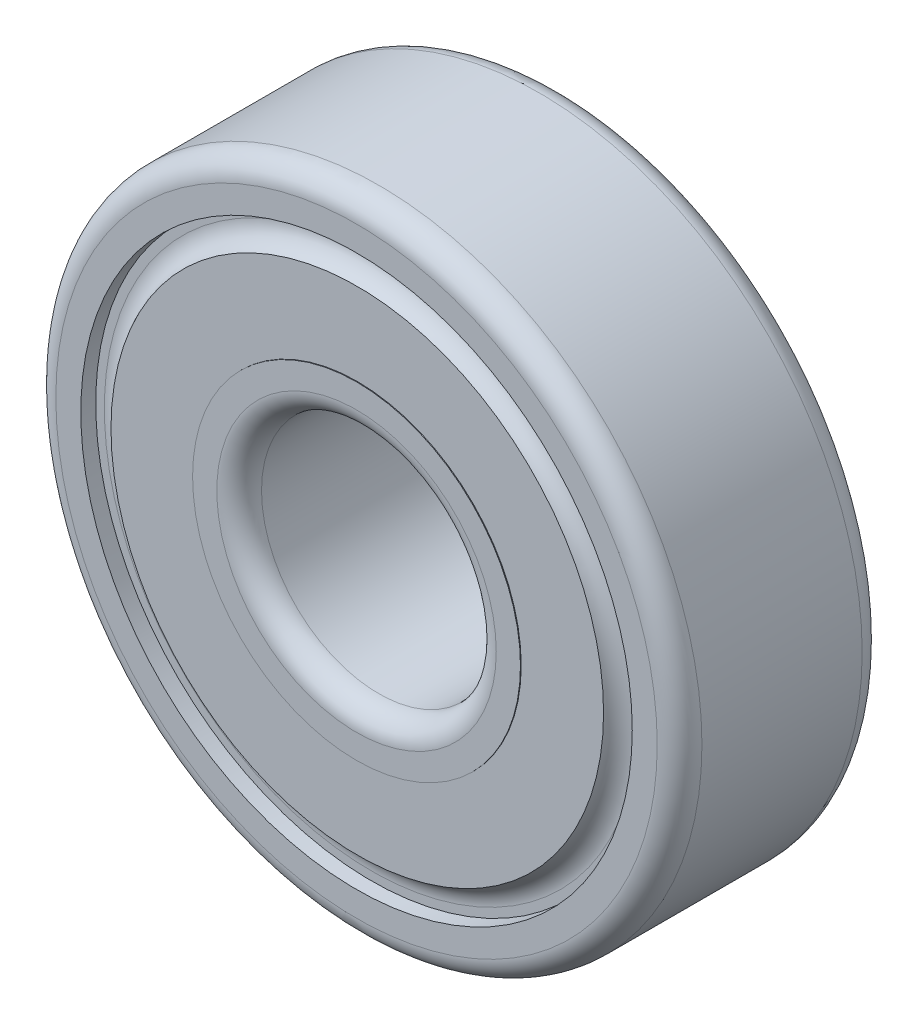
ISO-10303-21;
HEADER;
FILE_DESCRIPTION(('STEP AP214'),'2;1');
FILE_NAME('part.step','',(''),(''),'','','');
FILE_SCHEMA(('AUTOMOTIVE_DESIGN { 1 0 10303 214 1 1 1 1 }'));
ENDSEC;
DATA;
#1=APPLICATION_CONTEXT('core data for automotive mechanical design processes');
#2=APPLICATION_PROTOCOL_DEFINITION('international standard','automotive_design',2000,#1);
#3=PRODUCT_CONTEXT('',#1,'mechanical');
#4=PRODUCT('Part','Part','',(#3));
#5=PRODUCT_RELATED_PRODUCT_CATEGORY('part','',(#4));
#6=PRODUCT_DEFINITION_FORMATION('','',#4);
#7=PRODUCT_DEFINITION_CONTEXT('part definition',#1,'design');
#8=PRODUCT_DEFINITION('design','',#6,#7);
#9=PRODUCT_DEFINITION_SHAPE('','',#8);
#10=(LENGTH_UNIT() NAMED_UNIT(*) SI_UNIT(.MILLI.,.METRE.));
#11=(NAMED_UNIT(*) PLANE_ANGLE_UNIT() SI_UNIT($,.RADIAN.));
#12=(NAMED_UNIT(*) SI_UNIT($,.STERADIAN.) SOLID_ANGLE_UNIT());
#13=UNCERTAINTY_MEASURE_WITH_UNIT(LENGTH_MEASURE(1.E-05),#10,'distance_accuracy_value','');
#14=(GEOMETRIC_REPRESENTATION_CONTEXT(3) GLOBAL_UNCERTAINTY_ASSIGNED_CONTEXT((#13)) GLOBAL_UNIT_ASSIGNED_CONTEXT((#10,
#11,#12)) REPRESENTATION_CONTEXT('',''));
#15=CARTESIAN_POINT('',(0.,0.,0.));
#16=DIRECTION('',(0.,0.,1.));
#17=DIRECTION('',(1.,0.,0.));
#18=AXIS2_PLACEMENT_3D('',#15,#16,#17);
#19=CARTESIAN_POINT('',(0.,0.,-2.7305));
#20=DIRECTION('',(0.,0.,1.));
#21=DIRECTION('',(1.,0.,0.));
#22=AXIS2_PLACEMENT_3D('',#19,#20,#21);
#23=TOROIDAL_SURFACE('',#22,4.7625,0.762);
#24=CARTESIAN_POINT('',(0.,0.,-2.7305));
#25=DIRECTION('',(0.,0.,1.));
#26=DIRECTION('',(1.,0.,0.));
#27=AXIS2_PLACEMENT_3D('',#24,#25,#26);
#28=CIRCLE('',#27,4.0005);
#29=CARTESIAN_POINT('',(4.0005,0.,-2.7305));
#30=VERTEX_POINT('',#29);
#31=EDGE_CURVE('E10',#30,#30,#28,.T.);
#32=ORIENTED_EDGE('',*,*,#31,.T.);
#33=EDGE_LOOP('',(#32));
#34=FACE_BOUND('',#33,.T.);
#35=CARTESIAN_POINT('',(0.,0.,-3.4925));
#36=DIRECTION('',(0.,0.,1.));
#37=DIRECTION('',(1.,0.,0.));
#38=AXIS2_PLACEMENT_3D('',#35,#36,#37);
#39=CIRCLE('',#38,4.7625);
#40=CARTESIAN_POINT('',(4.7625,0.,-3.4925));
#41=VERTEX_POINT('',#40);
#42=EDGE_CURVE('E94',#41,#41,#39,.T.);
#43=ORIENTED_EDGE('',*,*,#42,.F.);
#44=EDGE_LOOP('',(#43));
#45=FACE_BOUND('',#44,.T.);
#46=ADVANCED_FACE('F30',(#34,#45),#23,.T.);
#47=CARTESIAN_POINT('',(0.,0.,-3.49531310558583));
#48=DIRECTION('',(0.,0.,1.));
#49=DIRECTION('',(1.,0.,0.));
#50=AXIS2_PLACEMENT_3D('',#47,#48,#49);
#51=CYLINDRICAL_SURFACE('',#50,4.0005);
#52=CARTESIAN_POINT('',(0.,0.,2.7305));
#53=DIRECTION('',(0.,0.,1.));
#54=DIRECTION('',(1.,0.,0.));
#55=AXIS2_PLACEMENT_3D('',#52,#53,#54);
#56=CIRCLE('',#55,4.0005);
#57=CARTESIAN_POINT('',(4.0005,0.,2.7305));
#58=VERTEX_POINT('',#57);
#59=EDGE_CURVE('E36',#58,#58,#56,.T.);
#60=ORIENTED_EDGE('',*,*,#59,.T.);
#61=EDGE_LOOP('',(#60));
#62=FACE_BOUND('',#61,.T.);
#63=ORIENTED_EDGE('',*,*,#31,.F.);
#64=EDGE_LOOP('',(#63));
#65=FACE_BOUND('',#64,.T.);
#66=ADVANCED_FACE('F102',(#62,#65),#51,.F.);
#67=CARTESIAN_POINT('',(0.,0.,2.7305));
#68=DIRECTION('',(0.,0.,1.));
#69=DIRECTION('',(1.,0.,0.));
#70=AXIS2_PLACEMENT_3D('',#67,#68,#69);
#71=TOROIDAL_SURFACE('',#70,4.7625,0.762);
#72=CARTESIAN_POINT('',(0.,0.,3.4925));
#73=DIRECTION('',(0.,0.,1.));
#74=DIRECTION('',(1.,0.,0.));
#75=AXIS2_PLACEMENT_3D('',#72,#73,#74);
#76=CIRCLE('',#75,4.7625);
#77=CARTESIAN_POINT('',(4.7625,0.,3.4925));
#78=VERTEX_POINT('',#77);
#79=EDGE_CURVE('E40',#78,#78,#76,.T.);
#80=ORIENTED_EDGE('',*,*,#79,.T.);
#81=EDGE_LOOP('',(#80));
#82=FACE_BOUND('',#81,.T.);
#83=ORIENTED_EDGE('',*,*,#59,.F.);
#84=EDGE_LOOP('',(#83));
#85=FACE_BOUND('',#84,.T.);
#86=ADVANCED_FACE('F106',(#82,#85),#71,.T.);
#87=CARTESIAN_POINT('',(4.7625,0.,3.4925));
#88=DIRECTION('',(0.,0.,1.));
#89=DIRECTION('',(1.,0.,0.));
#90=AXIS2_PLACEMENT_3D('',#87,#88,#89);
#91=PLANE('',#90);
#92=CARTESIAN_POINT('',(0.,0.,3.4925));
#93=DIRECTION('',(0.,0.,1.));
#94=DIRECTION('',(1.,0.,0.));
#95=AXIS2_PLACEMENT_3D('',#92,#93,#94);
#96=CIRCLE('',#95,5.588);
#97=CARTESIAN_POINT('',(5.588,0.,3.4925));
#98=VERTEX_POINT('',#97);
#99=EDGE_CURVE('E44',#98,#98,#96,.T.);
#100=ORIENTED_EDGE('',*,*,#99,.T.);
#101=EDGE_LOOP('',(#100));
#102=FACE_BOUND('',#101,.T.);
#103=ORIENTED_EDGE('',*,*,#79,.F.);
#104=EDGE_LOOP('',(#103));
#105=FACE_BOUND('',#104,.T.);
#106=ADVANCED_FACE('F110',(#102,#105),#91,.T.);
#107=CARTESIAN_POINT('',(0.,0.,-3.49531310558583));
#108=DIRECTION('',(0.,0.,1.));
#109=DIRECTION('',(1.,0.,0.));
#110=AXIS2_PLACEMENT_3D('',#107,#108,#109);
#111=CYLINDRICAL_SURFACE('',#110,5.588);
#112=CARTESIAN_POINT('',(0.,0.,3.4671));
#113=DIRECTION('',(0.,0.,1.));
#114=DIRECTION('',(1.,0.,0.));
#115=AXIS2_PLACEMENT_3D('',#112,#113,#114);
#116=CIRCLE('',#115,5.588);
#117=CARTESIAN_POINT('',(5.588,0.,3.4671));
#118=VERTEX_POINT('',#117);
#119=EDGE_CURVE('E49',#118,#118,#116,.T.);
#120=ORIENTED_EDGE('',*,*,#119,.T.);
#121=EDGE_LOOP('',(#120));
#122=FACE_BOUND('',#121,.T.);
#123=ORIENTED_EDGE('',*,*,#99,.F.);
#124=EDGE_LOOP('',(#123));
#125=FACE_BOUND('',#124,.T.);
#126=ADVANCED_FACE('F117',(#122,#125),#111,.T.);
#127=CARTESIAN_POINT('',(5.588,0.,3.4671));
#128=DIRECTION('',(0.,0.,1.));
#129=DIRECTION('',(1.,0.,0.));
#130=AXIS2_PLACEMENT_3D('',#127,#128,#129);
#131=PLANE('',#130);
#132=CARTESIAN_POINT('',(0.,0.,3.4671));
#133=DIRECTION('',(0.,0.,1.));
#134=DIRECTION('',(1.,0.,0.));
#135=AXIS2_PLACEMENT_3D('',#132,#133,#134);
#136=CIRCLE('',#135,8.3947);
#137=CARTESIAN_POINT('',(8.3947,0.,3.4671));
#138=VERTEX_POINT('',#137);
#139=EDGE_CURVE('E52',#138,#138,#136,.T.);
#140=ORIENTED_EDGE('',*,*,#139,.T.);
#141=EDGE_LOOP('',(#140));
#142=FACE_BOUND('',#141,.T.);
#143=ORIENTED_EDGE('',*,*,#119,.F.);
#144=EDGE_LOOP('',(#143));
#145=FACE_BOUND('',#144,.T.);
#146=ADVANCED_FACE('F121',(#142,#145),#131,.T.);
#147=CARTESIAN_POINT('',(0.,0.,3.7465));
#148=DIRECTION('',(0.,0.,1.));
#149=DIRECTION('',(1.,0.,0.));
#150=AXIS2_PLACEMENT_3D('',#147,#148,#149);
#151=TOROIDAL_SURFACE('',#150,9.10362851543721,0.762);
#152=CARTESIAN_POINT('',(0.,0.,2.9845));
#153=DIRECTION('',(0.,0.,1.));
#154=DIRECTION('',(1.,0.,0.));
#155=AXIS2_PLACEMENT_3D('',#152,#153,#154);
#156=CIRCLE('',#155,9.10362851543721);
#157=CARTESIAN_POINT('',(9.10362851543721,0.,2.9845));
#158=VERTEX_POINT('',#157);
#159=EDGE_CURVE('E55',#158,#158,#156,.T.);
#160=ORIENTED_EDGE('',*,*,#159,.T.);
#161=EDGE_LOOP('',(#160));
#162=FACE_BOUND('',#161,.T.);
#163=ORIENTED_EDGE('',*,*,#139,.F.);
#164=EDGE_LOOP('',(#163));
#165=FACE_BOUND('',#164,.T.);
#166=ADVANCED_FACE('F125',(#162,#165),#151,.F.);
#167=CARTESIAN_POINT('',(9.10362851543721,0.,2.9845));
#168=DIRECTION('',(0.,0.,1.));
#169=DIRECTION('',(1.,0.,0.));
#170=AXIS2_PLACEMENT_3D('',#167,#168,#169);
#171=PLANE('',#170);
#172=CARTESIAN_POINT('',(0.,0.,2.9845));
#173=DIRECTION('',(0.,0.,1.));
#174=DIRECTION('',(1.,0.,0.));
#175=AXIS2_PLACEMENT_3D('',#172,#173,#174);
#176=CIRCLE('',#175,9.398);
#177=CARTESIAN_POINT('',(9.398,0.,2.9845));
#178=VERTEX_POINT('',#177);
#179=EDGE_CURVE('E58',#178,#178,#176,.T.);
#180=ORIENTED_EDGE('',*,*,#179,.T.);
#181=EDGE_LOOP('',(#180));
#182=FACE_BOUND('',#181,.T.);
#183=ORIENTED_EDGE('',*,*,#159,.F.);
#184=EDGE_LOOP('',(#183));
#185=FACE_BOUND('',#184,.T.);
#186=ADVANCED_FACE('F129',(#182,#185),#171,.T.);
#187=CARTESIAN_POINT('',(0.,0.,-3.49531310558583));
#188=DIRECTION('',(0.,0.,1.));
#189=DIRECTION('',(1.,0.,0.));
#190=AXIS2_PLACEMENT_3D('',#187,#188,#189);
#191=CYLINDRICAL_SURFACE('',#190,9.398);
#192=CARTESIAN_POINT('',(0.,0.,3.4925));
#193=DIRECTION('',(0.,0.,1.));
#194=DIRECTION('',(1.,0.,0.));
#195=AXIS2_PLACEMENT_3D('',#192,#193,#194);
#196=CIRCLE('',#195,9.398);
#197=CARTESIAN_POINT('',(9.398,0.,3.4925));
#198=VERTEX_POINT('',#197);
#199=EDGE_CURVE('E61',#198,#198,#196,.T.);
#200=ORIENTED_EDGE('',*,*,#199,.T.);
#201=EDGE_LOOP('',(#200));
#202=FACE_BOUND('',#201,.T.);
#203=ORIENTED_EDGE('',*,*,#179,.F.);
#204=EDGE_LOOP('',(#203));
#205=FACE_BOUND('',#204,.T.);
#206=ADVANCED_FACE('F133',(#202,#205),#191,.F.);
#207=CARTESIAN_POINT('',(9.398,0.,3.4925));
#208=DIRECTION('',(0.,0.,1.));
#209=DIRECTION('',(1.,0.,0.));
#210=AXIS2_PLACEMENT_3D('',#207,#208,#209);
#211=PLANE('',#210);
#212=CARTESIAN_POINT('',(0.,0.,3.4925));
#213=DIRECTION('',(0.,0.,1.));
#214=DIRECTION('',(1.,0.,0.));
#215=AXIS2_PLACEMENT_3D('',#212,#213,#214);
#216=CIRCLE('',#215,10.2489);
#217=CARTESIAN_POINT('',(10.2489,0.,3.4925));
#218=VERTEX_POINT('',#217);
#219=EDGE_CURVE('E64',#218,#218,#216,.T.);
#220=ORIENTED_EDGE('',*,*,#219,.T.);
#221=EDGE_LOOP('',(#220));
#222=FACE_BOUND('',#221,.T.);
#223=ORIENTED_EDGE('',*,*,#199,.F.);
#224=EDGE_LOOP('',(#223));
#225=FACE_BOUND('',#224,.T.);
#226=ADVANCED_FACE('F137',(#222,#225),#211,.T.);
#227=CARTESIAN_POINT('',(0.,0.,2.7305));
#228=DIRECTION('',(0.,0.,1.));
#229=DIRECTION('',(1.,0.,0.));
#230=AXIS2_PLACEMENT_3D('',#227,#228,#229);
#231=TOROIDAL_SURFACE('',#230,10.2489,0.762);
#232=CARTESIAN_POINT('',(0.,0.,2.7305));
#233=DIRECTION('',(0.,0.,1.));
#234=DIRECTION('',(1.,0.,0.));
#235=AXIS2_PLACEMENT_3D('',#232,#233,#234);
#236=CIRCLE('',#235,11.0109);
#237=CARTESIAN_POINT('',(11.0109,0.,2.7305));
#238=VERTEX_POINT('',#237);
#239=EDGE_CURVE('E67',#238,#238,#236,.T.);
#240=ORIENTED_EDGE('',*,*,#239,.T.);
#241=EDGE_LOOP('',(#240));
#242=FACE_BOUND('',#241,.T.);
#243=ORIENTED_EDGE('',*,*,#219,.F.);
#244=EDGE_LOOP('',(#243));
#245=FACE_BOUND('',#244,.T.);
#246=ADVANCED_FACE('F141',(#242,#245),#231,.T.);
#247=CARTESIAN_POINT('',(0.,0.,-3.49531310558583));
#248=DIRECTION('',(0.,0.,1.));
#249=DIRECTION('',(1.,0.,0.));
#250=AXIS2_PLACEMENT_3D('',#247,#248,#249);
#251=CYLINDRICAL_SURFACE('',#250,11.0109);
#252=CARTESIAN_POINT('',(0.,0.,-2.7305));
#253=DIRECTION('',(0.,0.,1.));
#254=DIRECTION('',(1.,0.,0.));
#255=AXIS2_PLACEMENT_3D('',#252,#253,#254);
#256=CIRCLE('',#255,11.0109);
#257=CARTESIAN_POINT('',(11.0109,0.,-2.7305));
#258=VERTEX_POINT('',#257);
#259=EDGE_CURVE('E70',#258,#258,#256,.T.);
#260=ORIENTED_EDGE('',*,*,#259,.T.);
#261=EDGE_LOOP('',(#260));
#262=FACE_BOUND('',#261,.T.);
#263=ORIENTED_EDGE('',*,*,#239,.F.);
#264=EDGE_LOOP('',(#263));
#265=FACE_BOUND('',#264,.T.);
#266=ADVANCED_FACE('F145',(#262,#265),#251,.T.);
#267=CARTESIAN_POINT('',(0.,0.,-2.7305));
#268=DIRECTION('',(0.,0.,1.));
#269=DIRECTION('',(1.,0.,0.));
#270=AXIS2_PLACEMENT_3D('',#267,#268,#269);
#271=TOROIDAL_SURFACE('',#270,10.2489,0.762000000000001);
#272=CARTESIAN_POINT('',(0.,0.,-3.4925));
#273=DIRECTION('',(0.,0.,1.));
#274=DIRECTION('',(1.,0.,0.));
#275=AXIS2_PLACEMENT_3D('',#272,#273,#274);
#276=CIRCLE('',#275,10.2489);
#277=CARTESIAN_POINT('',(10.2489,0.,-3.4925));
#278=VERTEX_POINT('',#277);
#279=EDGE_CURVE('E73',#278,#278,#276,.T.);
#280=ORIENTED_EDGE('',*,*,#279,.T.);
#281=EDGE_LOOP('',(#280));
#282=FACE_BOUND('',#281,.T.);
#283=ORIENTED_EDGE('',*,*,#259,.F.);
#284=EDGE_LOOP('',(#283));
#285=FACE_BOUND('',#284,.T.);
#286=ADVANCED_FACE('F149',(#282,#285),#271,.T.);
#287=CARTESIAN_POINT('',(10.2489,0.,-3.4925));
#288=DIRECTION('',(0.,0.,-1.));
#289=DIRECTION('',(-1.,0.,0.));
#290=AXIS2_PLACEMENT_3D('',#287,#288,#289);
#291=PLANE('',#290);
#292=CARTESIAN_POINT('',(0.,0.,-3.4925));
#293=DIRECTION('',(0.,0.,1.));
#294=DIRECTION('',(1.,0.,0.));
#295=AXIS2_PLACEMENT_3D('',#292,#293,#294);
#296=CIRCLE('',#295,9.398);
#297=CARTESIAN_POINT('',(9.398,0.,-3.4925));
#298=VERTEX_POINT('',#297);
#299=EDGE_CURVE('E76',#298,#298,#296,.T.);
#300=ORIENTED_EDGE('',*,*,#299,.T.);
#301=EDGE_LOOP('',(#300));
#302=FACE_BOUND('',#301,.T.);
#303=ORIENTED_EDGE('',*,*,#279,.F.);
#304=EDGE_LOOP('',(#303));
#305=FACE_BOUND('',#304,.T.);
#306=ADVANCED_FACE('F153',(#302,#305),#291,.T.);
#307=CARTESIAN_POINT('',(0.,0.,-3.49531310558583));
#308=DIRECTION('',(0.,0.,1.));
#309=DIRECTION('',(1.,0.,0.));
#310=AXIS2_PLACEMENT_3D('',#307,#308,#309);
#311=CYLINDRICAL_SURFACE('',#310,9.398);
#312=CARTESIAN_POINT('',(0.,0.,-2.9845));
#313=DIRECTION('',(0.,0.,1.));
#314=DIRECTION('',(1.,0.,0.));
#315=AXIS2_PLACEMENT_3D('',#312,#313,#314);
#316=CIRCLE('',#315,9.398);
#317=CARTESIAN_POINT('',(9.398,0.,-2.9845));
#318=VERTEX_POINT('',#317);
#319=EDGE_CURVE('E79',#318,#318,#316,.T.);
#320=ORIENTED_EDGE('',*,*,#319,.T.);
#321=EDGE_LOOP('',(#320));
#322=FACE_BOUND('',#321,.T.);
#323=ORIENTED_EDGE('',*,*,#299,.F.);
#324=EDGE_LOOP('',(#323));
#325=FACE_BOUND('',#324,.T.);
#326=ADVANCED_FACE('F157',(#322,#325),#311,.F.);
#327=CARTESIAN_POINT('',(9.398,0.,-2.9845));
#328=DIRECTION('',(0.,0.,-1.));
#329=DIRECTION('',(-1.,0.,0.));
#330=AXIS2_PLACEMENT_3D('',#327,#328,#329);
#331=PLANE('',#330);
#332=CARTESIAN_POINT('',(0.,0.,-2.9845));
#333=DIRECTION('',(0.,0.,1.));
#334=DIRECTION('',(1.,0.,0.));
#335=AXIS2_PLACEMENT_3D('',#332,#333,#334);
#336=CIRCLE('',#335,8.3947);
#337=CARTESIAN_POINT('',(8.3947,0.,-2.9845));
#338=VERTEX_POINT('',#337);
#339=EDGE_CURVE('E82',#338,#338,#336,.T.);
#340=ORIENTED_EDGE('',*,*,#339,.T.);
#341=EDGE_LOOP('',(#340));
#342=FACE_BOUND('',#341,.T.);
#343=ORIENTED_EDGE('',*,*,#319,.F.);
#344=EDGE_LOOP('',(#343));
#345=FACE_BOUND('',#344,.T.);
#346=ADVANCED_FACE('F161',(#342,#345),#331,.T.);
#347=CARTESIAN_POINT('',(0.,0.,-3.49531310558583));
#348=DIRECTION('',(0.,0.,1.));
#349=DIRECTION('',(1.,0.,0.));
#350=AXIS2_PLACEMENT_3D('',#347,#348,#349);
#351=CYLINDRICAL_SURFACE('',#350,8.3947);
#352=CARTESIAN_POINT('',(0.,0.,-3.4671));
#353=DIRECTION('',(0.,0.,1.));
#354=DIRECTION('',(1.,0.,0.));
#355=AXIS2_PLACEMENT_3D('',#352,#353,#354);
#356=CIRCLE('',#355,8.3947);
#357=CARTESIAN_POINT('',(8.3947,0.,-3.4671));
#358=VERTEX_POINT('',#357);
#359=EDGE_CURVE('E85',#358,#358,#356,.T.);
#360=ORIENTED_EDGE('',*,*,#359,.T.);
#361=EDGE_LOOP('',(#360));
#362=FACE_BOUND('',#361,.T.);
#363=ORIENTED_EDGE('',*,*,#339,.F.);
#364=EDGE_LOOP('',(#363));
#365=FACE_BOUND('',#364,.T.);
#366=ADVANCED_FACE('F165',(#362,#365),#351,.T.);
#367=CARTESIAN_POINT('',(8.3947,0.,-3.4671));
#368=DIRECTION('',(0.,0.,-1.));
#369=DIRECTION('',(-1.,0.,0.));
#370=AXIS2_PLACEMENT_3D('',#367,#368,#369);
#371=PLANE('',#370);
#372=CARTESIAN_POINT('',(0.,0.,-3.4671));
#373=DIRECTION('',(0.,0.,1.));
#374=DIRECTION('',(1.,0.,0.));
#375=AXIS2_PLACEMENT_3D('',#372,#373,#374);
#376=CIRCLE('',#375,5.588);
#377=CARTESIAN_POINT('',(5.588,0.,-3.4671));
#378=VERTEX_POINT('',#377);
#379=EDGE_CURVE('E88',#378,#378,#376,.T.);
#380=ORIENTED_EDGE('',*,*,#379,.T.);
#381=EDGE_LOOP('',(#380));
#382=FACE_BOUND('',#381,.T.);
#383=ORIENTED_EDGE('',*,*,#359,.F.);
#384=EDGE_LOOP('',(#383));
#385=FACE_BOUND('',#384,.T.);
#386=ADVANCED_FACE('F169',(#382,#385),#371,.T.);
#387=CARTESIAN_POINT('',(0.,0.,-3.49531310558583));
#388=DIRECTION('',(0.,0.,1.));
#389=DIRECTION('',(1.,0.,0.));
#390=AXIS2_PLACEMENT_3D('',#387,#388,#389);
#391=CYLINDRICAL_SURFACE('',#390,5.588);
#392=CARTESIAN_POINT('',(0.,0.,-3.4925));
#393=DIRECTION('',(0.,0.,1.));
#394=DIRECTION('',(1.,0.,0.));
#395=AXIS2_PLACEMENT_3D('',#392,#393,#394);
#396=CIRCLE('',#395,5.588);
#397=CARTESIAN_POINT('',(5.588,0.,-3.4925));
#398=VERTEX_POINT('',#397);
#399=EDGE_CURVE('E91',#398,#398,#396,.T.);
#400=ORIENTED_EDGE('',*,*,#399,.T.);
#401=EDGE_LOOP('',(#400));
#402=FACE_BOUND('',#401,.T.);
#403=ORIENTED_EDGE('',*,*,#379,.F.);
#404=EDGE_LOOP('',(#403));
#405=FACE_BOUND('',#404,.T.);
#406=ADVANCED_FACE('F173',(#402,#405),#391,.T.);
#407=CARTESIAN_POINT('',(5.588,0.,-3.4925));
#408=DIRECTION('',(0.,0.,-1.));
#409=DIRECTION('',(-1.,0.,0.));
#410=AXIS2_PLACEMENT_3D('',#407,#408,#409);
#411=PLANE('',#410);
#412=ORIENTED_EDGE('',*,*,#42,.T.);
#413=EDGE_LOOP('',(#412));
#414=FACE_BOUND('',#413,.T.);
#415=ORIENTED_EDGE('',*,*,#399,.F.);
#416=EDGE_LOOP('',(#415));
#417=FACE_BOUND('',#416,.T.);
#418=ADVANCED_FACE('F98',(#414,#417),#411,.T.);
#419=CLOSED_SHELL('',(#46,#66,#86,#106,#126,#146,#166,#186,#206,#226,#246,#266,#286,#306,#326,
#346,#366,#386,#406,#418));
#420=MANIFOLD_SOLID_BREP('B2',#419);
#421=ADVANCED_BREP_SHAPE_REPRESENTATION('',(#18,#420),#14);
#422=SHAPE_DEFINITION_REPRESENTATION(#9,#421);
ENDSEC;
END-ISO-10303-21;
